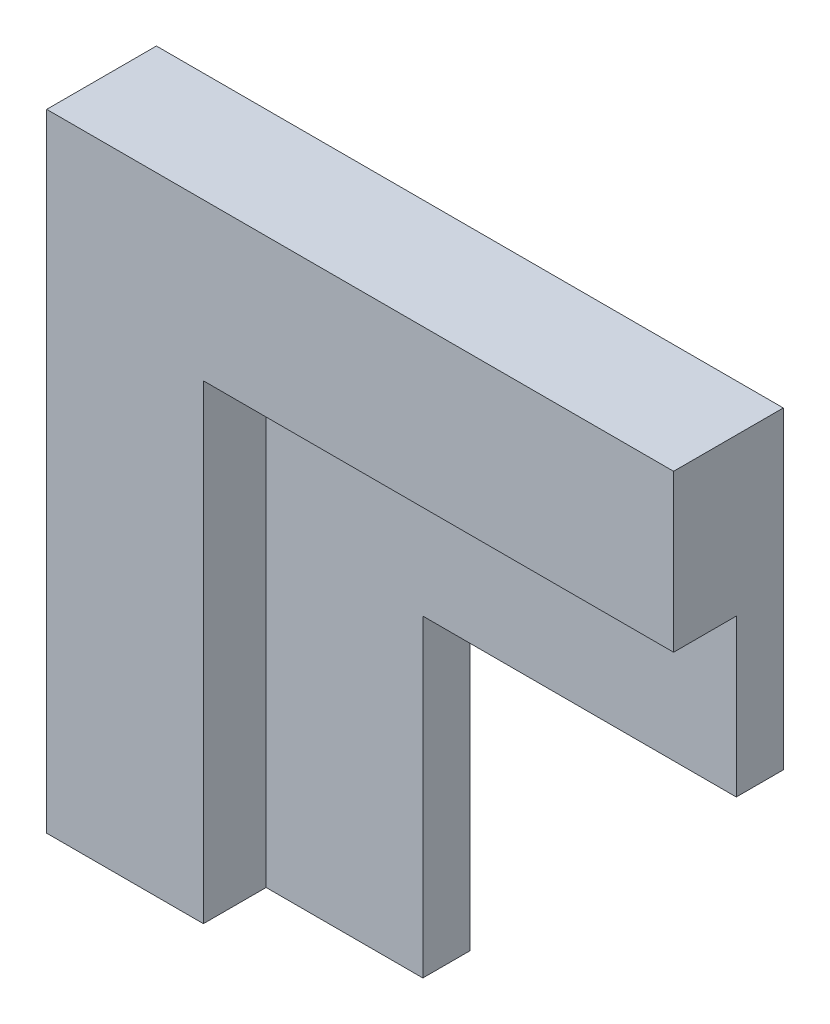
ISO-10303-21;
HEADER;
FILE_DESCRIPTION(('STEP AP214'),'2;1');
FILE_NAME('part.step','',(''),(''),'','','');
FILE_SCHEMA(('AUTOMOTIVE_DESIGN { 1 0 10303 214 1 1 1 1 }'));
ENDSEC;
DATA;
#1=APPLICATION_CONTEXT('core data for automotive mechanical design processes');
#2=APPLICATION_PROTOCOL_DEFINITION('international standard','automotive_design',2000,#1);
#3=PRODUCT_CONTEXT('',#1,'mechanical');
#4=PRODUCT('Part','Part','',(#3));
#5=PRODUCT_RELATED_PRODUCT_CATEGORY('part','',(#4));
#6=PRODUCT_DEFINITION_FORMATION('','',#4);
#7=PRODUCT_DEFINITION_CONTEXT('part definition',#1,'design');
#8=PRODUCT_DEFINITION('design','',#6,#7);
#9=PRODUCT_DEFINITION_SHAPE('','',#8);
#10=(LENGTH_UNIT() NAMED_UNIT(*) SI_UNIT(.MILLI.,.METRE.));
#11=(NAMED_UNIT(*) PLANE_ANGLE_UNIT() SI_UNIT($,.RADIAN.));
#12=(NAMED_UNIT(*) SI_UNIT($,.STERADIAN.) SOLID_ANGLE_UNIT());
#13=UNCERTAINTY_MEASURE_WITH_UNIT(LENGTH_MEASURE(1.E-05),#10,'distance_accuracy_value','');
#14=(GEOMETRIC_REPRESENTATION_CONTEXT(3) GLOBAL_UNCERTAINTY_ASSIGNED_CONTEXT((#13)) GLOBAL_UNIT_ASSIGNED_CONTEXT((#10,
#11,#12)) REPRESENTATION_CONTEXT('',''));
#15=CARTESIAN_POINT('',(0.,0.,0.));
#16=DIRECTION('',(0.,0.,1.));
#17=DIRECTION('',(1.,0.,0.));
#18=AXIS2_PLACEMENT_3D('',#15,#16,#17);
#19=CARTESIAN_POINT('',(0.,0.,0.));
#20=DIRECTION('',(0.,0.,1.));
#21=DIRECTION('',(1.,0.,0.));
#22=AXIS2_PLACEMENT_3D('',#19,#20,#21);
#23=PLANE('',#22);
#24=DIRECTION('',(-1.,0.,0.));
#25=VECTOR('',#24,1.);
#26=CARTESIAN_POINT('',(40.,0.,0.));
#27=LINE('',#26,#25);
#28=CARTESIAN_POINT('',(40.,0.,0.));
#29=VERTEX_POINT('',#28);
#30=CARTESIAN_POINT('',(0.,0.,0.));
#31=VERTEX_POINT('',#30);
#32=EDGE_CURVE('E181',#29,#31,#27,.T.);
#33=ORIENTED_EDGE('',*,*,#32,.F.);
#34=DIRECTION('',(0.,1.,0.));
#35=VECTOR('',#34,1.);
#36=CARTESIAN_POINT('',(40.,0.,0.));
#37=LINE('',#36,#35);
#38=CARTESIAN_POINT('',(40.,-20.,0.));
#39=VERTEX_POINT('',#38);
#40=EDGE_CURVE('E195',#39,#29,#37,.T.);
#41=ORIENTED_EDGE('',*,*,#40,.F.);
#42=DIRECTION('',(1.,0.,0.));
#43=VECTOR('',#42,1.);
#44=CARTESIAN_POINT('',(0.,-20.,0.));
#45=LINE('',#44,#43);
#46=CARTESIAN_POINT('',(20.,-20.,0.));
#47=VERTEX_POINT('',#46);
#48=EDGE_CURVE('E211',#47,#39,#45,.T.);
#49=ORIENTED_EDGE('',*,*,#48,.F.);
#50=DIRECTION('',(0.,1.,0.));
#51=VECTOR('',#50,1.);
#52=CARTESIAN_POINT('',(20.,0.,0.));
#53=LINE('',#52,#51);
#54=CARTESIAN_POINT('',(20.,-40.,0.));
#55=VERTEX_POINT('',#54);
#56=EDGE_CURVE('E208',#55,#47,#53,.T.);
#57=ORIENTED_EDGE('',*,*,#56,.F.);
#58=DIRECTION('',(1.,0.,0.));
#59=VECTOR('',#58,1.);
#60=CARTESIAN_POINT('',(0.,-40.,0.));
#61=LINE('',#60,#59);
#62=CARTESIAN_POINT('',(0.,-40.,0.));
#63=VERTEX_POINT('',#62);
#64=EDGE_CURVE('E205',#63,#55,#61,.T.);
#65=ORIENTED_EDGE('',*,*,#64,.F.);
#66=DIRECTION('',(0.,-1.,0.));
#67=VECTOR('',#66,1.);
#68=CARTESIAN_POINT('',(0.,0.,0.));
#69=LINE('',#68,#67);
#70=EDGE_CURVE('E185',#31,#63,#69,.T.);
#71=ORIENTED_EDGE('',*,*,#70,.F.);
#72=EDGE_LOOP('',(#33,#41,#49,#57,#65,#71));
#73=FACE_BOUND('',#72,.T.);
#74=ADVANCED_FACE('F83',(#73),#23,.F.);
#75=CARTESIAN_POINT('',(0.,-20.,3.));
#76=DIRECTION('',(0.,1.,0.));
#77=DIRECTION('',(0.,0.,1.));
#78=AXIS2_PLACEMENT_3D('',#75,#76,#77);
#79=PLANE('',#78);
#80=ORIENTED_EDGE('',*,*,#48,.T.);
#81=DIRECTION('',(0.,0.,-1.));
#82=VECTOR('',#81,1.);
#83=CARTESIAN_POINT('',(40.,-20.,3.));
#84=LINE('',#83,#82);
#85=CARTESIAN_POINT('',(40.,-20.,3.));
#86=VERTEX_POINT('',#85);
#87=EDGE_CURVE('E204',#86,#39,#84,.T.);
#88=ORIENTED_EDGE('',*,*,#87,.F.);
#89=DIRECTION('',(1.,0.,0.));
#90=VECTOR('',#89,1.);
#91=CARTESIAN_POINT('',(0.,-20.,3.));
#92=LINE('',#91,#90);
#93=CARTESIAN_POINT('',(20.,-20.,3.));
#94=VERTEX_POINT('',#93);
#95=EDGE_CURVE('E198',#94,#86,#92,.T.);
#96=ORIENTED_EDGE('',*,*,#95,.F.);
#97=DIRECTION('',(0.,0.,-1.));
#98=VECTOR('',#97,1.);
#99=CARTESIAN_POINT('',(20.,-20.,3.));
#100=LINE('',#99,#98);
#101=EDGE_CURVE('E93',#94,#47,#100,.T.);
#102=ORIENTED_EDGE('',*,*,#101,.T.);
#103=EDGE_LOOP('',(#80,#88,#96,#102));
#104=FACE_BOUND('',#103,.T.);
#105=ADVANCED_FACE('F271',(#104),#79,.F.);
#106=CARTESIAN_POINT('',(20.,0.,3.));
#107=DIRECTION('',(-1.,0.,0.));
#108=DIRECTION('',(0.,0.,1.));
#109=AXIS2_PLACEMENT_3D('',#106,#107,#108);
#110=PLANE('',#109);
#111=ORIENTED_EDGE('',*,*,#56,.T.);
#112=ORIENTED_EDGE('',*,*,#101,.F.);
#113=DIRECTION('',(0.,1.,0.));
#114=VECTOR('',#113,1.);
#115=CARTESIAN_POINT('',(20.,0.,3.));
#116=LINE('',#115,#114);
#117=CARTESIAN_POINT('',(20.,-40.,3.));
#118=VERTEX_POINT('',#117);
#119=EDGE_CURVE('E194',#118,#94,#116,.T.);
#120=ORIENTED_EDGE('',*,*,#119,.F.);
#121=DIRECTION('',(0.,0.,-1.));
#122=VECTOR('',#121,1.);
#123=CARTESIAN_POINT('',(20.,-40.,3.));
#124=LINE('',#123,#122);
#125=EDGE_CURVE('E12',#118,#55,#124,.T.);
#126=ORIENTED_EDGE('',*,*,#125,.T.);
#127=EDGE_LOOP('',(#111,#112,#120,#126));
#128=FACE_BOUND('',#127,.T.);
#129=ADVANCED_FACE('F267',(#128),#110,.F.);
#130=CARTESIAN_POINT('',(0.,-40.,3.));
#131=DIRECTION('',(0.,1.,0.));
#132=DIRECTION('',(0.,0.,1.));
#133=AXIS2_PLACEMENT_3D('',#130,#131,#132);
#134=PLANE('',#133);
#135=ORIENTED_EDGE('',*,*,#64,.T.);
#136=ORIENTED_EDGE('',*,*,#125,.F.);
#137=DIRECTION('',(1.,0.,0.));
#138=VECTOR('',#137,1.);
#139=CARTESIAN_POINT('',(0.,-40.,3.));
#140=LINE('',#139,#138);
#141=CARTESIAN_POINT('',(10.,-40.,3.));
#142=VERTEX_POINT('',#141);
#143=EDGE_CURVE('E191',#142,#118,#140,.T.);
#144=ORIENTED_EDGE('',*,*,#143,.F.);
#145=DIRECTION('',(0.,0.,-1.));
#146=VECTOR('',#145,1.);
#147=CARTESIAN_POINT('',(10.,-40.,7.));
#148=LINE('',#147,#146);
#149=CARTESIAN_POINT('',(10.,-40.,7.));
#150=VERTEX_POINT('',#149);
#151=EDGE_CURVE('E187',#150,#142,#148,.T.);
#152=ORIENTED_EDGE('',*,*,#151,.F.);
#153=DIRECTION('',(1.,0.,0.));
#154=VECTOR('',#153,1.);
#155=CARTESIAN_POINT('',(0.,-40.,7.));
#156=LINE('',#155,#154);
#157=CARTESIAN_POINT('',(0.,-40.,7.));
#158=VERTEX_POINT('',#157);
#159=EDGE_CURVE('E173',#158,#150,#156,.T.);
#160=ORIENTED_EDGE('',*,*,#159,.F.);
#161=DIRECTION('',(0.,0.,-1.));
#162=VECTOR('',#161,1.);
#163=CARTESIAN_POINT('',(0.,-40.,3.));
#164=LINE('',#163,#162);
#165=EDGE_CURVE('E225',#158,#63,#164,.T.);
#166=ORIENTED_EDGE('',*,*,#165,.T.);
#167=EDGE_LOOP('',(#135,#136,#144,#152,#160,#166));
#168=FACE_BOUND('',#167,.T.);
#169=ADVANCED_FACE('F259',(#168),#134,.F.);
#170=CARTESIAN_POINT('',(40.,0.,3.));
#171=DIRECTION('',(-1.,0.,0.));
#172=DIRECTION('',(0.,0.,1.));
#173=AXIS2_PLACEMENT_3D('',#170,#171,#172);
#174=PLANE('',#173);
#175=ORIENTED_EDGE('',*,*,#40,.T.);
#176=DIRECTION('',(0.,0.,-1.));
#177=VECTOR('',#176,1.);
#178=CARTESIAN_POINT('',(40.,0.,3.));
#179=LINE('',#178,#177);
#180=CARTESIAN_POINT('',(40.,0.,7.));
#181=VERTEX_POINT('',#180);
#182=EDGE_CURVE('E87',#181,#29,#179,.T.);
#183=ORIENTED_EDGE('',*,*,#182,.F.);
#184=DIRECTION('',(0.,1.,0.));
#185=VECTOR('',#184,1.);
#186=CARTESIAN_POINT('',(40.,0.,7.));
#187=LINE('',#186,#185);
#188=CARTESIAN_POINT('',(40.,-10.,7.));
#189=VERTEX_POINT('',#188);
#190=EDGE_CURVE('E166',#189,#181,#187,.T.);
#191=ORIENTED_EDGE('',*,*,#190,.F.);
#192=DIRECTION('',(0.,0.,-1.));
#193=VECTOR('',#192,1.);
#194=CARTESIAN_POINT('',(40.,-10.,7.));
#195=LINE('',#194,#193);
#196=CARTESIAN_POINT('',(40.,-10.,3.));
#197=VERTEX_POINT('',#196);
#198=EDGE_CURVE('E161',#189,#197,#195,.T.);
#199=ORIENTED_EDGE('',*,*,#198,.T.);
#200=DIRECTION('',(0.,1.,0.));
#201=VECTOR('',#200,1.);
#202=CARTESIAN_POINT('',(40.,0.,3.));
#203=LINE('',#202,#201);
#204=EDGE_CURVE('E201',#86,#197,#203,.T.);
#205=ORIENTED_EDGE('',*,*,#204,.F.);
#206=ORIENTED_EDGE('',*,*,#87,.T.);
#207=EDGE_LOOP('',(#175,#183,#191,#199,#205,#206));
#208=FACE_BOUND('',#207,.T.);
#209=ADVANCED_FACE('F242',(#208),#174,.F.);
#210=CARTESIAN_POINT('',(0.,0.,3.));
#211=DIRECTION('',(0.,0.,1.));
#212=DIRECTION('',(1.,0.,0.));
#213=AXIS2_PLACEMENT_3D('',#210,#211,#212);
#214=PLANE('',#213);
#215=DIRECTION('',(0.,1.,0.));
#216=VECTOR('',#215,1.);
#217=CARTESIAN_POINT('',(10.,0.,3.));
#218=LINE('',#217,#216);
#219=CARTESIAN_POINT('',(10.,-10.,3.));
#220=VERTEX_POINT('',#219);
#221=EDGE_CURVE('E106',#142,#220,#218,.T.);
#222=ORIENTED_EDGE('',*,*,#221,.F.);
#223=ORIENTED_EDGE('',*,*,#143,.T.);
#224=ORIENTED_EDGE('',*,*,#119,.T.);
#225=ORIENTED_EDGE('',*,*,#95,.T.);
#226=ORIENTED_EDGE('',*,*,#204,.T.);
#227=DIRECTION('',(1.,0.,0.));
#228=VECTOR('',#227,1.);
#229=CARTESIAN_POINT('',(0.,-10.,3.));
#230=LINE('',#229,#228);
#231=EDGE_CURVE('E101',#220,#197,#230,.T.);
#232=ORIENTED_EDGE('',*,*,#231,.F.);
#233=EDGE_LOOP('',(#222,#223,#224,#225,#226,#232));
#234=FACE_BOUND('',#233,.T.);
#235=ADVANCED_FACE('F262',(#234),#214,.T.);
#236=CARTESIAN_POINT('',(40.,0.,3.));
#237=DIRECTION('',(0.,-1.,0.));
#238=DIRECTION('',(1.,0.,0.));
#239=AXIS2_PLACEMENT_3D('',#236,#237,#238);
#240=PLANE('',#239);
#241=ORIENTED_EDGE('',*,*,#32,.T.);
#242=DIRECTION('',(0.,0.,-1.));
#243=VECTOR('',#242,1.);
#244=CARTESIAN_POINT('',(0.,0.,3.));
#245=LINE('',#244,#243);
#246=CARTESIAN_POINT('',(0.,0.,7.));
#247=VERTEX_POINT('',#246);
#248=EDGE_CURVE('E228',#247,#31,#245,.T.);
#249=ORIENTED_EDGE('',*,*,#248,.F.);
#250=DIRECTION('',(-1.,0.,0.));
#251=VECTOR('',#250,1.);
#252=CARTESIAN_POINT('',(0.,0.,7.));
#253=LINE('',#252,#251);
#254=EDGE_CURVE('E240',#181,#247,#253,.T.);
#255=ORIENTED_EDGE('',*,*,#254,.F.);
#256=ORIENTED_EDGE('',*,*,#182,.T.);
#257=EDGE_LOOP('',(#241,#249,#255,#256));
#258=FACE_BOUND('',#257,.T.);
#259=ADVANCED_FACE('F85',(#258),#240,.F.);
#260=CARTESIAN_POINT('',(0.,0.,3.));
#261=DIRECTION('',(1.,0.,0.));
#262=DIRECTION('',(0.,1.,0.));
#263=AXIS2_PLACEMENT_3D('',#260,#261,#262);
#264=PLANE('',#263);
#265=ORIENTED_EDGE('',*,*,#70,.T.);
#266=ORIENTED_EDGE('',*,*,#165,.F.);
#267=DIRECTION('',(0.,-1.,0.));
#268=VECTOR('',#267,1.);
#269=CARTESIAN_POINT('',(0.,0.,7.));
#270=LINE('',#269,#268);
#271=EDGE_CURVE('E247',#247,#158,#270,.T.);
#272=ORIENTED_EDGE('',*,*,#271,.F.);
#273=ORIENTED_EDGE('',*,*,#248,.T.);
#274=EDGE_LOOP('',(#265,#266,#272,#273));
#275=FACE_BOUND('',#274,.T.);
#276=ADVANCED_FACE('F274',(#275),#264,.F.);
#277=CARTESIAN_POINT('',(10.,0.,7.));
#278=DIRECTION('',(-1.,0.,0.));
#279=DIRECTION('',(0.,0.,1.));
#280=AXIS2_PLACEMENT_3D('',#277,#278,#279);
#281=PLANE('',#280);
#282=ORIENTED_EDGE('',*,*,#221,.T.);
#283=DIRECTION('',(0.,0.,-1.));
#284=VECTOR('',#283,1.);
#285=CARTESIAN_POINT('',(10.,-10.,7.));
#286=LINE('',#285,#284);
#287=CARTESIAN_POINT('',(10.,-10.,7.));
#288=VERTEX_POINT('',#287);
#289=EDGE_CURVE('E159',#288,#220,#286,.T.);
#290=ORIENTED_EDGE('',*,*,#289,.F.);
#291=DIRECTION('',(0.,1.,0.));
#292=VECTOR('',#291,1.);
#293=CARTESIAN_POINT('',(10.,0.,7.));
#294=LINE('',#293,#292);
#295=EDGE_CURVE('E167',#150,#288,#294,.T.);
#296=ORIENTED_EDGE('',*,*,#295,.F.);
#297=ORIENTED_EDGE('',*,*,#151,.T.);
#298=EDGE_LOOP('',(#282,#290,#296,#297));
#299=FACE_BOUND('',#298,.T.);
#300=ADVANCED_FACE('F179',(#299),#281,.F.);
#301=CARTESIAN_POINT('',(0.,-10.,7.));
#302=DIRECTION('',(0.,1.,0.));
#303=DIRECTION('',(0.,0.,1.));
#304=AXIS2_PLACEMENT_3D('',#301,#302,#303);
#305=PLANE('',#304);
#306=ORIENTED_EDGE('',*,*,#231,.T.);
#307=ORIENTED_EDGE('',*,*,#198,.F.);
#308=DIRECTION('',(1.,0.,0.));
#309=VECTOR('',#308,1.);
#310=CARTESIAN_POINT('',(0.,-10.,7.));
#311=LINE('',#310,#309);
#312=EDGE_CURVE('E155',#288,#189,#311,.T.);
#313=ORIENTED_EDGE('',*,*,#312,.F.);
#314=ORIENTED_EDGE('',*,*,#289,.T.);
#315=EDGE_LOOP('',(#306,#307,#313,#314));
#316=FACE_BOUND('',#315,.T.);
#317=ADVANCED_FACE('F157',(#316),#305,.F.);
#318=CARTESIAN_POINT('',(0.,0.,7.));
#319=DIRECTION('',(0.,0.,1.));
#320=DIRECTION('',(1.,0.,0.));
#321=AXIS2_PLACEMENT_3D('',#318,#319,#320);
#322=PLANE('',#321);
#323=ORIENTED_EDGE('',*,*,#295,.T.);
#324=ORIENTED_EDGE('',*,*,#312,.T.);
#325=ORIENTED_EDGE('',*,*,#190,.T.);
#326=ORIENTED_EDGE('',*,*,#254,.T.);
#327=ORIENTED_EDGE('',*,*,#271,.T.);
#328=ORIENTED_EDGE('',*,*,#159,.T.);
#329=EDGE_LOOP('',(#323,#324,#325,#326,#327,#328));
#330=FACE_BOUND('',#329,.T.);
#331=ADVANCED_FACE('F170',(#330),#322,.T.);
#332=CLOSED_SHELL('',(#74,#105,#129,#169,#209,#235,#259,#276,#300,#317,#331));
#333=MANIFOLD_SOLID_BREP('B2',#332);
#334=ADVANCED_BREP_SHAPE_REPRESENTATION('',(#18,#333),#14);
#335=SHAPE_DEFINITION_REPRESENTATION(#9,#334);
ENDSEC;
END-ISO-10303-21;
